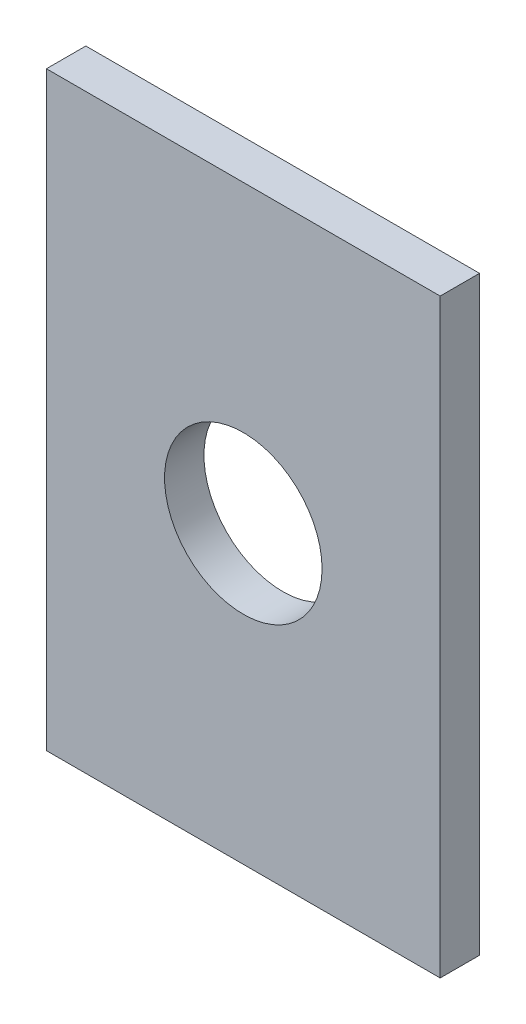
ISO-10303-21;
HEADER;
FILE_DESCRIPTION(('STEP AP214'),'2;1');
FILE_NAME('part.step','',(''),(''),'','','');
FILE_SCHEMA(('AUTOMOTIVE_DESIGN { 1 0 10303 214 1 1 1 1 }'));
ENDSEC;
DATA;
#1=APPLICATION_CONTEXT('core data for automotive mechanical design processes');
#2=APPLICATION_PROTOCOL_DEFINITION('international standard','automotive_design',2000,#1);
#3=PRODUCT_CONTEXT('',#1,'mechanical');
#4=PRODUCT('Part','Part','',(#3));
#5=PRODUCT_RELATED_PRODUCT_CATEGORY('part','',(#4));
#6=PRODUCT_DEFINITION_FORMATION('','',#4);
#7=PRODUCT_DEFINITION_CONTEXT('part definition',#1,'design');
#8=PRODUCT_DEFINITION('design','',#6,#7);
#9=PRODUCT_DEFINITION_SHAPE('','',#8);
#10=(LENGTH_UNIT() NAMED_UNIT(*) SI_UNIT(.MILLI.,.METRE.));
#11=(NAMED_UNIT(*) PLANE_ANGLE_UNIT() SI_UNIT($,.RADIAN.));
#12=(NAMED_UNIT(*) SI_UNIT($,.STERADIAN.) SOLID_ANGLE_UNIT());
#13=UNCERTAINTY_MEASURE_WITH_UNIT(LENGTH_MEASURE(1.E-05),#10,'distance_accuracy_value','');
#14=(GEOMETRIC_REPRESENTATION_CONTEXT(3) GLOBAL_UNCERTAINTY_ASSIGNED_CONTEXT((#13)) GLOBAL_UNIT_ASSIGNED_CONTEXT((#10,
#11,#12)) REPRESENTATION_CONTEXT('',''));
#15=CARTESIAN_POINT('',(0.,0.,0.));
#16=DIRECTION('',(0.,0.,1.));
#17=DIRECTION('',(1.,0.,0.));
#18=AXIS2_PLACEMENT_3D('',#15,#16,#17);
#19=CARTESIAN_POINT('',(0.,0.,2.));
#20=DIRECTION('',(0.,0.,-1.));
#21=DIRECTION('',(-1.,0.,0.));
#22=AXIS2_PLACEMENT_3D('',#19,#20,#21);
#23=PLANE('',#22);
#24=DIRECTION('',(0.,-1.,0.));
#25=VECTOR('',#24,1.);
#26=CARTESIAN_POINT('',(0.,0.,2.));
#27=LINE('',#26,#25);
#28=CARTESIAN_POINT('',(0.,30.,2.));
#29=VERTEX_POINT('',#28);
#30=CARTESIAN_POINT('',(0.,0.,2.));
#31=VERTEX_POINT('',#30);
#32=EDGE_CURVE('E89',#29,#31,#27,.T.);
#33=ORIENTED_EDGE('',*,*,#32,.T.);
#34=DIRECTION('',(1.,0.,0.));
#35=VECTOR('',#34,1.);
#36=CARTESIAN_POINT('',(0.,0.,2.));
#37=LINE('',#36,#35);
#38=CARTESIAN_POINT('',(20.,0.,2.));
#39=VERTEX_POINT('',#38);
#40=EDGE_CURVE('E84',#31,#39,#37,.T.);
#41=ORIENTED_EDGE('',*,*,#40,.T.);
#42=DIRECTION('',(0.,1.,0.));
#43=VECTOR('',#42,1.);
#44=CARTESIAN_POINT('',(20.,0.,2.));
#45=LINE('',#44,#43);
#46=CARTESIAN_POINT('',(20.,30.,2.));
#47=VERTEX_POINT('',#46);
#48=EDGE_CURVE('E87',#39,#47,#45,.T.);
#49=ORIENTED_EDGE('',*,*,#48,.T.);
#50=DIRECTION('',(-1.,0.,0.));
#51=VECTOR('',#50,1.);
#52=CARTESIAN_POINT('',(0.,30.,2.));
#53=LINE('',#52,#51);
#54=EDGE_CURVE('E54',#47,#29,#53,.T.);
#55=ORIENTED_EDGE('',*,*,#54,.T.);
#56=EDGE_LOOP('',(#33,#41,#49,#55));
#57=FACE_BOUND('',#56,.T.);
#58=CARTESIAN_POINT('',(10.,15.,2.));
#59=DIRECTION('',(0.,0.,1.));
#60=DIRECTION('',(1.,0.,0.));
#61=AXIS2_PLACEMENT_3D('',#58,#59,#60);
#62=CIRCLE('',#61,4.);
#63=CARTESIAN_POINT('',(14.,15.,2.));
#64=VERTEX_POINT('',#63);
#65=EDGE_CURVE('E104',#64,#64,#62,.T.);
#66=ORIENTED_EDGE('',*,*,#65,.F.);
#67=EDGE_LOOP('',(#66));
#68=FACE_BOUND('',#67,.T.);
#69=ADVANCED_FACE('F37',(#57,#68),#23,.F.);
#70=CARTESIAN_POINT('',(0.,0.,0.));
#71=DIRECTION('',(0.,0.,-1.));
#72=DIRECTION('',(-1.,0.,0.));
#73=AXIS2_PLACEMENT_3D('',#70,#71,#72);
#74=PLANE('',#73);
#75=DIRECTION('',(0.,-1.,0.));
#76=VECTOR('',#75,1.);
#77=CARTESIAN_POINT('',(0.,0.,0.));
#78=LINE('',#77,#76);
#79=CARTESIAN_POINT('',(0.,30.,0.));
#80=VERTEX_POINT('',#79);
#81=CARTESIAN_POINT('',(0.,0.,0.));
#82=VERTEX_POINT('',#81);
#83=EDGE_CURVE('E101',#80,#82,#78,.T.);
#84=ORIENTED_EDGE('',*,*,#83,.F.);
#85=DIRECTION('',(-1.,0.,0.));
#86=VECTOR('',#85,1.);
#87=CARTESIAN_POINT('',(0.,30.,0.));
#88=LINE('',#87,#86);
#89=CARTESIAN_POINT('',(20.,30.,0.));
#90=VERTEX_POINT('',#89);
#91=EDGE_CURVE('E77',#90,#80,#88,.T.);
#92=ORIENTED_EDGE('',*,*,#91,.F.);
#93=DIRECTION('',(0.,1.,0.));
#94=VECTOR('',#93,1.);
#95=CARTESIAN_POINT('',(20.,0.,0.));
#96=LINE('',#95,#94);
#97=CARTESIAN_POINT('',(20.,0.,0.));
#98=VERTEX_POINT('',#97);
#99=EDGE_CURVE('E71',#98,#90,#96,.T.);
#100=ORIENTED_EDGE('',*,*,#99,.F.);
#101=DIRECTION('',(1.,0.,0.));
#102=VECTOR('',#101,1.);
#103=CARTESIAN_POINT('',(0.,0.,0.));
#104=LINE('',#103,#102);
#105=EDGE_CURVE('E93',#82,#98,#104,.T.);
#106=ORIENTED_EDGE('',*,*,#105,.F.);
#107=EDGE_LOOP('',(#84,#92,#100,#106));
#108=FACE_BOUND('',#107,.T.);
#109=CARTESIAN_POINT('',(10.,15.,0.));
#110=DIRECTION('',(0.,0.,1.));
#111=DIRECTION('',(1.,0.,0.));
#112=AXIS2_PLACEMENT_3D('',#109,#110,#111);
#113=CIRCLE('',#112,4.);
#114=CARTESIAN_POINT('',(14.,15.,0.));
#115=VERTEX_POINT('',#114);
#116=EDGE_CURVE('E116',#115,#115,#113,.T.);
#117=ORIENTED_EDGE('',*,*,#116,.T.);
#118=EDGE_LOOP('',(#117));
#119=FACE_BOUND('',#118,.T.);
#120=ADVANCED_FACE('F112',(#108,#119),#74,.T.);
#121=CARTESIAN_POINT('',(0.,0.,2.));
#122=DIRECTION('',(1.,0.,0.));
#123=DIRECTION('',(0.,0.,-1.));
#124=AXIS2_PLACEMENT_3D('',#121,#122,#123);
#125=PLANE('',#124);
#126=ORIENTED_EDGE('',*,*,#83,.T.);
#127=DIRECTION('',(0.,0.,-1.));
#128=VECTOR('',#127,1.);
#129=CARTESIAN_POINT('',(0.,0.,2.));
#130=LINE('',#129,#128);
#131=EDGE_CURVE('E11',#31,#82,#130,.T.);
#132=ORIENTED_EDGE('',*,*,#131,.F.);
#133=ORIENTED_EDGE('',*,*,#32,.F.);
#134=DIRECTION('',(0.,0.,-1.));
#135=VECTOR('',#134,1.);
#136=CARTESIAN_POINT('',(0.,30.,2.));
#137=LINE('',#136,#135);
#138=EDGE_CURVE('E97',#29,#80,#137,.T.);
#139=ORIENTED_EDGE('',*,*,#138,.T.);
#140=EDGE_LOOP('',(#126,#132,#133,#139));
#141=FACE_BOUND('',#140,.T.);
#142=ADVANCED_FACE('F39',(#141),#125,.F.);
#143=CARTESIAN_POINT('',(0.,0.,2.));
#144=DIRECTION('',(0.,1.,0.));
#145=DIRECTION('',(0.,0.,1.));
#146=AXIS2_PLACEMENT_3D('',#143,#144,#145);
#147=PLANE('',#146);
#148=ORIENTED_EDGE('',*,*,#105,.T.);
#149=DIRECTION('',(0.,0.,-1.));
#150=VECTOR('',#149,1.);
#151=CARTESIAN_POINT('',(20.,0.,2.));
#152=LINE('',#151,#150);
#153=EDGE_CURVE('E46',#39,#98,#152,.T.);
#154=ORIENTED_EDGE('',*,*,#153,.F.);
#155=ORIENTED_EDGE('',*,*,#40,.F.);
#156=ORIENTED_EDGE('',*,*,#131,.T.);
#157=EDGE_LOOP('',(#148,#154,#155,#156));
#158=FACE_BOUND('',#157,.T.);
#159=ADVANCED_FACE('F92',(#158),#147,.F.);
#160=CARTESIAN_POINT('',(20.,0.,2.));
#161=DIRECTION('',(-1.,0.,0.));
#162=DIRECTION('',(0.,0.,1.));
#163=AXIS2_PLACEMENT_3D('',#160,#161,#162);
#164=PLANE('',#163);
#165=ORIENTED_EDGE('',*,*,#99,.T.);
#166=DIRECTION('',(0.,0.,-1.));
#167=VECTOR('',#166,1.);
#168=CARTESIAN_POINT('',(20.,30.,2.));
#169=LINE('',#168,#167);
#170=EDGE_CURVE('E94',#47,#90,#169,.T.);
#171=ORIENTED_EDGE('',*,*,#170,.F.);
#172=ORIENTED_EDGE('',*,*,#48,.F.);
#173=ORIENTED_EDGE('',*,*,#153,.T.);
#174=EDGE_LOOP('',(#165,#171,#172,#173));
#175=FACE_BOUND('',#174,.T.);
#176=ADVANCED_FACE('F95',(#175),#164,.F.);
#177=CARTESIAN_POINT('',(0.,30.,2.));
#178=DIRECTION('',(0.,-1.,0.));
#179=DIRECTION('',(0.,0.,-1.));
#180=AXIS2_PLACEMENT_3D('',#177,#178,#179);
#181=PLANE('',#180);
#182=ORIENTED_EDGE('',*,*,#91,.T.);
#183=ORIENTED_EDGE('',*,*,#138,.F.);
#184=ORIENTED_EDGE('',*,*,#54,.F.);
#185=ORIENTED_EDGE('',*,*,#170,.T.);
#186=EDGE_LOOP('',(#182,#183,#184,#185));
#187=FACE_BOUND('',#186,.T.);
#188=ADVANCED_FACE('F109',(#187),#181,.F.);
#189=CARTESIAN_POINT('',(10.,15.,2.));
#190=DIRECTION('',(0.,0.,-1.));
#191=DIRECTION('',(-1.,0.,0.));
#192=AXIS2_PLACEMENT_3D('',#189,#190,#191);
#193=CYLINDRICAL_SURFACE('',#192,4.);
#194=ORIENTED_EDGE('',*,*,#65,.T.);
#195=EDGE_LOOP('',(#194));
#196=FACE_BOUND('',#195,.T.);
#197=ORIENTED_EDGE('',*,*,#116,.F.);
#198=EDGE_LOOP('',(#197));
#199=FACE_BOUND('',#198,.T.);
#200=ADVANCED_FACE('F122',(#196,#199),#193,.F.);
#201=CLOSED_SHELL('',(#69,#120,#142,#159,#176,#188,#200));
#202=MANIFOLD_SOLID_BREP('B2',#201);
#203=ADVANCED_BREP_SHAPE_REPRESENTATION('',(#18,#202),#14);
#204=SHAPE_DEFINITION_REPRESENTATION(#9,#203);
ENDSEC;
END-ISO-10303-21;
